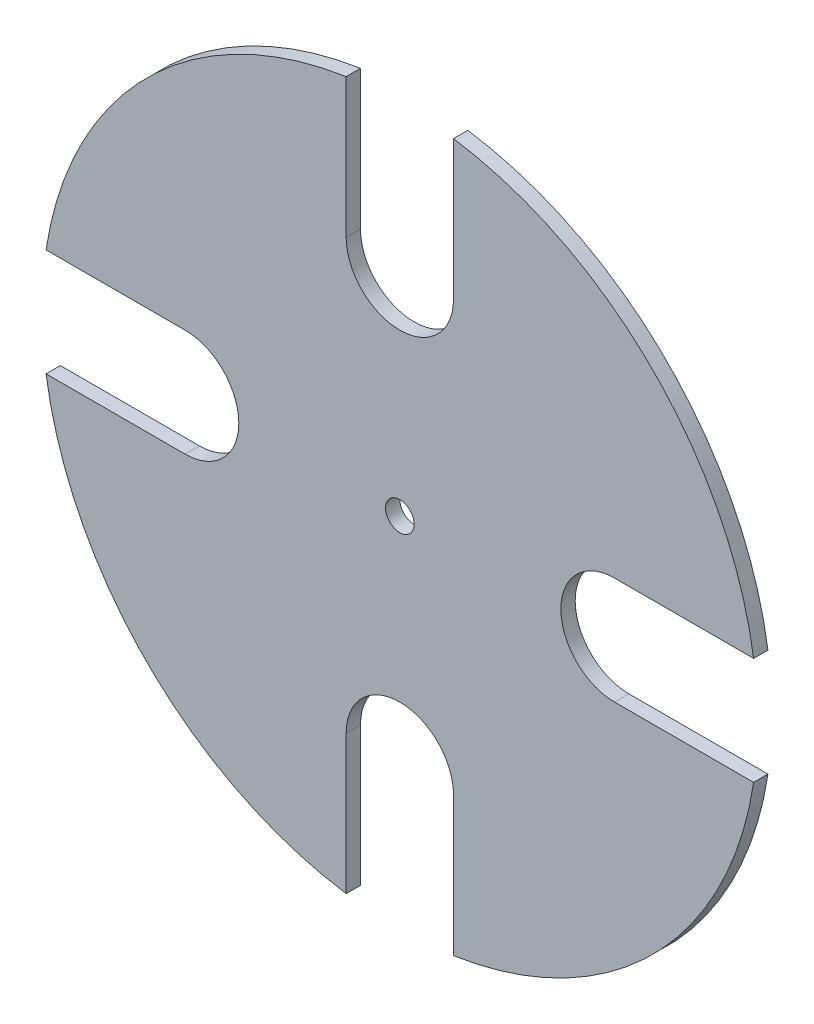
ISO-10303-21;
HEADER;
FILE_DESCRIPTION(('STEP AP214'),'2;1');
FILE_NAME('part.step','',(''),(''),'','','');
FILE_SCHEMA(('AUTOMOTIVE_DESIGN { 1 0 10303 214 1 1 1 1 }'));
ENDSEC;
DATA;
#1=APPLICATION_CONTEXT('core data for automotive mechanical design processes');
#2=APPLICATION_PROTOCOL_DEFINITION('international standard','automotive_design',2000,#1);
#3=PRODUCT_CONTEXT('',#1,'mechanical');
#4=PRODUCT('Part','Part','',(#3));
#5=PRODUCT_RELATED_PRODUCT_CATEGORY('part','',(#4));
#6=PRODUCT_DEFINITION_FORMATION('','',#4);
#7=PRODUCT_DEFINITION_CONTEXT('part definition',#1,'design');
#8=PRODUCT_DEFINITION('design','',#6,#7);
#9=PRODUCT_DEFINITION_SHAPE('','',#8);
#10=(LENGTH_UNIT() NAMED_UNIT(*) SI_UNIT(.MILLI.,.METRE.));
#11=(NAMED_UNIT(*) PLANE_ANGLE_UNIT() SI_UNIT($,.RADIAN.));
#12=(NAMED_UNIT(*) SI_UNIT($,.STERADIAN.) SOLID_ANGLE_UNIT());
#13=UNCERTAINTY_MEASURE_WITH_UNIT(LENGTH_MEASURE(1.E-05),#10,'distance_accuracy_value','');
#14=(GEOMETRIC_REPRESENTATION_CONTEXT(3) GLOBAL_UNCERTAINTY_ASSIGNED_CONTEXT((#13)) GLOBAL_UNIT_ASSIGNED_CONTEXT((#10,
#11,#12)) REPRESENTATION_CONTEXT('',''));
#15=CARTESIAN_POINT('',(0.,0.,0.));
#16=DIRECTION('',(0.,0.,1.));
#17=DIRECTION('',(1.,0.,0.));
#18=AXIS2_PLACEMENT_3D('',#15,#16,#17);
#19=CARTESIAN_POINT('',(0.,0.,4.));
#20=DIRECTION('',(0.,0.,-1.));
#21=DIRECTION('',(-1.,0.,0.));
#22=AXIS2_PLACEMENT_3D('',#19,#20,#21);
#23=CYLINDRICAL_SURFACE('',#22,100.);
#24=CARTESIAN_POINT('',(0.,0.,4.));
#25=DIRECTION('',(0.,0.,1.));
#26=DIRECTION('',(1.,0.,0.));
#27=AXIS2_PLACEMENT_3D('',#24,#25,#26);
#28=CIRCLE('',#27,100.);
#29=CARTESIAN_POINT('',(98.8685996664258,15.000000000001,4.));
#30=VERTEX_POINT('',#29);
#31=CARTESIAN_POINT('',(15.,98.868599666426,4.));
#32=VERTEX_POINT('',#31);
#33=EDGE_CURVE('E195',#30,#32,#28,.T.);
#34=ORIENTED_EDGE('',*,*,#33,.F.);
#35=DIRECTION('',(0.,0.,-1.));
#36=VECTOR('',#35,1.);
#37=CARTESIAN_POINT('',(98.8685996664258,15.000000000001,4.));
#38=LINE('',#37,#36);
#39=CARTESIAN_POINT('',(98.8685996664258,15.000000000001,0.));
#40=VERTEX_POINT('',#39);
#41=EDGE_CURVE('E260',#30,#40,#38,.T.);
#42=ORIENTED_EDGE('',*,*,#41,.T.);
#43=CARTESIAN_POINT('',(0.,0.,0.));
#44=DIRECTION('',(0.,0.,1.));
#45=DIRECTION('',(1.,0.,0.));
#46=AXIS2_PLACEMENT_3D('',#43,#44,#45);
#47=CIRCLE('',#46,100.);
#48=CARTESIAN_POINT('',(15.,98.868599666426,0.));
#49=VERTEX_POINT('',#48);
#50=EDGE_CURVE('E198',#40,#49,#47,.T.);
#51=ORIENTED_EDGE('',*,*,#50,.T.);
#52=DIRECTION('',(0.,0.,-1.));
#53=VECTOR('',#52,1.);
#54=CARTESIAN_POINT('',(15.,98.868599666426,4.));
#55=LINE('',#54,#53);
#56=EDGE_CURVE('E160',#49,#32,#55,.F.);
#57=ORIENTED_EDGE('',*,*,#56,.T.);
#58=EDGE_LOOP('',(#34,#42,#51,#57));
#59=FACE_BOUND('',#58,.T.);
#60=ADVANCED_FACE('F38',(#59),#23,.T.);
#61=CARTESIAN_POINT('',(60.,6.28466640991764E-13,357.588744164743));
#62=DIRECTION('',(0.,0.,-1.));
#63=DIRECTION('',(0.,1.,0.));
#64=AXIS2_PLACEMENT_3D('',#61,#62,#63);
#65=CYLINDRICAL_SURFACE('',#64,15.);
#66=DIRECTION('',(0.,0.,-1.));
#67=VECTOR('',#66,1.);
#68=CARTESIAN_POINT('',(60.0000000000002,-14.9999999999994,357.588744164743));
#69=LINE('',#68,#67);
#70=CARTESIAN_POINT('',(60.0000000000002,-14.9999999999994,4.));
#71=VERTEX_POINT('',#70);
#72=CARTESIAN_POINT('',(60.0000000000002,-14.9999999999994,0.));
#73=VERTEX_POINT('',#72);
#74=EDGE_CURVE('E61',#71,#73,#69,.T.);
#75=ORIENTED_EDGE('',*,*,#74,.T.);
#76=CARTESIAN_POINT('',(60.,6.28466640991764E-13,0.));
#77=DIRECTION('',(0.,0.,1.));
#78=DIRECTION('',(0.,-1.,0.));
#79=AXIS2_PLACEMENT_3D('',#76,#77,#78);
#80=CIRCLE('',#79,15.);
#81=CARTESIAN_POINT('',(59.9999999999999,15.0000000000006,0.));
#82=VERTEX_POINT('',#81);
#83=EDGE_CURVE('E46',#73,#82,#80,.F.);
#84=ORIENTED_EDGE('',*,*,#83,.T.);
#85=DIRECTION('',(0.,0.,-1.));
#86=VECTOR('',#85,1.);
#87=CARTESIAN_POINT('',(59.9999999999999,15.0000000000006,357.588744164743));
#88=LINE('',#87,#86);
#89=CARTESIAN_POINT('',(59.9999999999999,15.0000000000006,4.));
#90=VERTEX_POINT('',#89);
#91=EDGE_CURVE('E266',#90,#82,#88,.T.);
#92=ORIENTED_EDGE('',*,*,#91,.F.);
#93=CARTESIAN_POINT('',(60.,6.28466640991764E-13,4.));
#94=DIRECTION('',(0.,0.,1.));
#95=DIRECTION('',(0.,-1.,0.));
#96=AXIS2_PLACEMENT_3D('',#93,#94,#95);
#97=CIRCLE('',#96,15.);
#98=EDGE_CURVE('E11',#71,#90,#97,.F.);
#99=ORIENTED_EDGE('',*,*,#98,.F.);
#100=EDGE_LOOP('',(#75,#84,#92,#99));
#101=FACE_BOUND('',#100,.T.);
#102=ADVANCED_FACE('F40',(#101),#65,.F.);
#103=CARTESIAN_POINT('',(60.0000000000002,-14.9999999999994,357.588744164743));
#104=DIRECTION('',(0.,-1.,0.));
#105=DIRECTION('',(0.,0.,-1.));
#106=AXIS2_PLACEMENT_3D('',#103,#104,#105);
#107=PLANE('',#106);
#108=DIRECTION('',(0.,0.,-1.));
#109=VECTOR('',#108,1.);
#110=CARTESIAN_POINT('',(98.8685996664261,-14.999999999999,4.));
#111=LINE('',#110,#109);
#112=CARTESIAN_POINT('',(98.8685996664261,-14.999999999999,0.));
#113=VERTEX_POINT('',#112);
#114=CARTESIAN_POINT('',(98.8685996664261,-14.999999999999,4.));
#115=VERTEX_POINT('',#114);
#116=EDGE_CURVE('E271',#113,#115,#111,.F.);
#117=ORIENTED_EDGE('',*,*,#116,.F.);
#118=DIRECTION('',(-1.,0.,0.));
#119=VECTOR('',#118,1.);
#120=CARTESIAN_POINT('',(60.0000000000002,-14.9999999999994,0.));
#121=LINE('',#120,#119);
#122=EDGE_CURVE('E273',#113,#73,#121,.T.);
#123=ORIENTED_EDGE('',*,*,#122,.T.);
#124=ORIENTED_EDGE('',*,*,#74,.F.);
#125=DIRECTION('',(-1.,0.,0.));
#126=VECTOR('',#125,1.);
#127=CARTESIAN_POINT('',(60.0000000000002,-14.9999999999994,4.));
#128=LINE('',#127,#126);
#129=EDGE_CURVE('E276',#115,#71,#128,.T.);
#130=ORIENTED_EDGE('',*,*,#129,.F.);
#131=EDGE_LOOP('',(#117,#123,#124,#130));
#132=FACE_BOUND('',#131,.T.);
#133=ADVANCED_FACE('F289',(#132),#107,.F.);
#134=CARTESIAN_POINT('',(59.9999999999999,15.0000000000006,357.588744164743));
#135=DIRECTION('',(0.,1.,0.));
#136=DIRECTION('',(0.,0.,1.));
#137=AXIS2_PLACEMENT_3D('',#134,#135,#136);
#138=PLANE('',#137);
#139=ORIENTED_EDGE('',*,*,#41,.F.);
#140=DIRECTION('',(1.,0.,0.));
#141=VECTOR('',#140,1.);
#142=CARTESIAN_POINT('',(59.9999999999999,15.0000000000006,4.));
#143=LINE('',#142,#141);
#144=EDGE_CURVE('E263',#90,#30,#143,.T.);
#145=ORIENTED_EDGE('',*,*,#144,.F.);
#146=ORIENTED_EDGE('',*,*,#91,.T.);
#147=DIRECTION('',(1.,0.,0.));
#148=VECTOR('',#147,1.);
#149=CARTESIAN_POINT('',(59.9999999999999,15.0000000000006,0.));
#150=LINE('',#149,#148);
#151=EDGE_CURVE('E268',#82,#40,#150,.T.);
#152=ORIENTED_EDGE('',*,*,#151,.T.);
#153=EDGE_LOOP('',(#139,#145,#146,#152));
#154=FACE_BOUND('',#153,.T.);
#155=ADVANCED_FACE('F286',(#154),#138,.F.);
#156=CARTESIAN_POINT('',(15.,-98.868599666426,4.));
#157=VERTEX_POINT('',#156);
#158=EDGE_CURVE('E53',#157,#115,#28,.T.);
#159=ORIENTED_EDGE('',*,*,#158,.F.);
#160=DIRECTION('',(0.,0.,-1.));
#161=VECTOR('',#160,1.);
#162=CARTESIAN_POINT('',(15.,-98.868599666426,4.));
#163=LINE('',#162,#161);
#164=CARTESIAN_POINT('',(15.,-98.868599666426,0.));
#165=VERTEX_POINT('',#164);
#166=EDGE_CURVE('E232',#157,#165,#163,.T.);
#167=ORIENTED_EDGE('',*,*,#166,.T.);
#168=EDGE_CURVE('E236',#165,#113,#47,.T.);
#169=ORIENTED_EDGE('',*,*,#168,.T.);
#170=ORIENTED_EDGE('',*,*,#116,.T.);
#171=EDGE_LOOP('',(#159,#167,#169,#170));
#172=FACE_BOUND('',#171,.T.);
#173=ADVANCED_FACE('F291',(#172),#23,.T.);
#174=CARTESIAN_POINT('',(0.,-60.,357.588744164743));
#175=DIRECTION('',(0.,0.,-1.));
#176=DIRECTION('',(1.,0.,0.));
#177=AXIS2_PLACEMENT_3D('',#174,#175,#176);
#178=CYLINDRICAL_SURFACE('',#177,15.);
#179=DIRECTION('',(0.,0.,-1.));
#180=VECTOR('',#179,1.);
#181=CARTESIAN_POINT('',(-15.,-60.,357.588744164743));
#182=LINE('',#181,#180);
#183=CARTESIAN_POINT('',(-15.,-60.,4.));
#184=VERTEX_POINT('',#183);
#185=CARTESIAN_POINT('',(-15.,-60.,0.));
#186=VERTEX_POINT('',#185);
#187=EDGE_CURVE('E248',#184,#186,#182,.T.);
#188=ORIENTED_EDGE('',*,*,#187,.T.);
#189=CARTESIAN_POINT('',(0.,-60.,0.));
#190=DIRECTION('',(0.,0.,1.));
#191=DIRECTION('',(-1.,0.,0.));
#192=AXIS2_PLACEMENT_3D('',#189,#190,#191);
#193=CIRCLE('',#192,15.);
#194=CARTESIAN_POINT('',(15.,-60.,0.));
#195=VERTEX_POINT('',#194);
#196=EDGE_CURVE('E254',#186,#195,#193,.F.);
#197=ORIENTED_EDGE('',*,*,#196,.T.);
#198=DIRECTION('',(0.,0.,-1.));
#199=VECTOR('',#198,1.);
#200=CARTESIAN_POINT('',(15.,-60.,357.588744164743));
#201=LINE('',#200,#199);
#202=CARTESIAN_POINT('',(15.,-60.,4.));
#203=VERTEX_POINT('',#202);
#204=EDGE_CURVE('E238',#203,#195,#201,.T.);
#205=ORIENTED_EDGE('',*,*,#204,.F.);
#206=CARTESIAN_POINT('',(0.,-60.,4.));
#207=DIRECTION('',(0.,0.,1.));
#208=DIRECTION('',(-1.,0.,0.));
#209=AXIS2_PLACEMENT_3D('',#206,#207,#208);
#210=CIRCLE('',#209,15.);
#211=EDGE_CURVE('E257',#184,#203,#210,.F.);
#212=ORIENTED_EDGE('',*,*,#211,.F.);
#213=EDGE_LOOP('',(#188,#197,#205,#212));
#214=FACE_BOUND('',#213,.T.);
#215=ADVANCED_FACE('F304',(#214),#178,.F.);
#216=CARTESIAN_POINT('',(-15.,-60.,357.588744164743));
#217=DIRECTION('',(-1.,0.,0.));
#218=DIRECTION('',(0.,0.,-1.));
#219=AXIS2_PLACEMENT_3D('',#216,#217,#218);
#220=PLANE('',#219);
#221=DIRECTION('',(0.,0.,-1.));
#222=VECTOR('',#221,1.);
#223=CARTESIAN_POINT('',(-15.,-98.868599666426,4.));
#224=LINE('',#223,#222);
#225=CARTESIAN_POINT('',(-15.,-98.868599666426,0.));
#226=VERTEX_POINT('',#225);
#227=CARTESIAN_POINT('',(-15.,-98.868599666426,4.));
#228=VERTEX_POINT('',#227);
#229=EDGE_CURVE('E243',#226,#228,#224,.F.);
#230=ORIENTED_EDGE('',*,*,#229,.F.);
#231=DIRECTION('',(0.,1.,0.));
#232=VECTOR('',#231,1.);
#233=CARTESIAN_POINT('',(-15.,-60.,0.));
#234=LINE('',#233,#232);
#235=EDGE_CURVE('E246',#226,#186,#234,.T.);
#236=ORIENTED_EDGE('',*,*,#235,.T.);
#237=ORIENTED_EDGE('',*,*,#187,.F.);
#238=DIRECTION('',(0.,1.,0.));
#239=VECTOR('',#238,1.);
#240=CARTESIAN_POINT('',(-15.,-60.,4.));
#241=LINE('',#240,#239);
#242=EDGE_CURVE('E251',#228,#184,#241,.T.);
#243=ORIENTED_EDGE('',*,*,#242,.F.);
#244=EDGE_LOOP('',(#230,#236,#237,#243));
#245=FACE_BOUND('',#244,.T.);
#246=ADVANCED_FACE('F329',(#245),#220,.F.);
#247=CARTESIAN_POINT('',(15.,-60.,357.588744164743));
#248=DIRECTION('',(1.,0.,0.));
#249=DIRECTION('',(0.,0.,1.));
#250=AXIS2_PLACEMENT_3D('',#247,#248,#249);
#251=PLANE('',#250);
#252=ORIENTED_EDGE('',*,*,#166,.F.);
#253=DIRECTION('',(0.,-1.,0.));
#254=VECTOR('',#253,1.);
#255=CARTESIAN_POINT('',(15.,-60.,4.));
#256=LINE('',#255,#254);
#257=EDGE_CURVE('E235',#203,#157,#256,.T.);
#258=ORIENTED_EDGE('',*,*,#257,.F.);
#259=ORIENTED_EDGE('',*,*,#204,.T.);
#260=DIRECTION('',(0.,-1.,0.));
#261=VECTOR('',#260,1.);
#262=CARTESIAN_POINT('',(15.,-60.,0.));
#263=LINE('',#262,#261);
#264=EDGE_CURVE('E240',#195,#165,#263,.T.);
#265=ORIENTED_EDGE('',*,*,#264,.T.);
#266=EDGE_LOOP('',(#252,#258,#259,#265));
#267=FACE_BOUND('',#266,.T.);
#268=ADVANCED_FACE('F320',(#267),#251,.F.);
#269=CARTESIAN_POINT('',(-98.8685996664259,-15.0000000000003,4.));
#270=VERTEX_POINT('',#269);
#271=EDGE_CURVE('E196',#270,#228,#28,.T.);
#272=ORIENTED_EDGE('',*,*,#271,.F.);
#273=DIRECTION('',(0.,0.,-1.));
#274=VECTOR('',#273,1.);
#275=CARTESIAN_POINT('',(-98.8685996664259,-15.0000000000003,4.));
#276=LINE('',#275,#274);
#277=CARTESIAN_POINT('',(-98.8685996664259,-15.0000000000003,0.));
#278=VERTEX_POINT('',#277);
#279=EDGE_CURVE('E204',#270,#278,#276,.T.);
#280=ORIENTED_EDGE('',*,*,#279,.T.);
#281=EDGE_CURVE('E199',#278,#226,#47,.T.);
#282=ORIENTED_EDGE('',*,*,#281,.T.);
#283=ORIENTED_EDGE('',*,*,#229,.T.);
#284=EDGE_LOOP('',(#272,#280,#282,#283));
#285=FACE_BOUND('',#284,.T.);
#286=ADVANCED_FACE('F305',(#285),#23,.T.);
#287=CARTESIAN_POINT('',(-60.,-2.09488880330588E-13,357.588744164743));
#288=DIRECTION('',(0.,0.,-1.));
#289=DIRECTION('',(0.,-1.,0.));
#290=AXIS2_PLACEMENT_3D('',#287,#288,#289);
#291=CYLINDRICAL_SURFACE('',#290,15.);
#292=DIRECTION('',(0.,0.,-1.));
#293=VECTOR('',#292,1.);
#294=CARTESIAN_POINT('',(-60.0000000000001,14.9999999999998,357.588744164743));
#295=LINE('',#294,#293);
#296=CARTESIAN_POINT('',(-60.0000000000001,14.9999999999998,4.));
#297=VERTEX_POINT('',#296);
#298=CARTESIAN_POINT('',(-60.0000000000001,14.9999999999998,0.));
#299=VERTEX_POINT('',#298);
#300=EDGE_CURVE('E220',#297,#299,#295,.T.);
#301=ORIENTED_EDGE('',*,*,#300,.T.);
#302=CARTESIAN_POINT('',(-60.,-2.09488880330588E-13,0.));
#303=DIRECTION('',(0.,0.,1.));
#304=DIRECTION('',(0.,1.,0.));
#305=AXIS2_PLACEMENT_3D('',#302,#303,#304);
#306=CIRCLE('',#305,15.);
#307=CARTESIAN_POINT('',(-60.,-15.0000000000002,0.));
#308=VERTEX_POINT('',#307);
#309=EDGE_CURVE('E226',#299,#308,#306,.F.);
#310=ORIENTED_EDGE('',*,*,#309,.T.);
#311=DIRECTION('',(0.,0.,-1.));
#312=VECTOR('',#311,1.);
#313=CARTESIAN_POINT('',(-60.,-15.0000000000002,357.588744164743));
#314=LINE('',#313,#312);
#315=CARTESIAN_POINT('',(-60.,-15.0000000000002,4.));
#316=VERTEX_POINT('',#315);
#317=EDGE_CURVE('E210',#316,#308,#314,.T.);
#318=ORIENTED_EDGE('',*,*,#317,.F.);
#319=CARTESIAN_POINT('',(-60.,-2.09488880330588E-13,4.));
#320=DIRECTION('',(0.,0.,1.));
#321=DIRECTION('',(0.,1.,0.));
#322=AXIS2_PLACEMENT_3D('',#319,#320,#321);
#323=CIRCLE('',#322,15.);
#324=EDGE_CURVE('E229',#297,#316,#323,.F.);
#325=ORIENTED_EDGE('',*,*,#324,.F.);
#326=EDGE_LOOP('',(#301,#310,#318,#325));
#327=FACE_BOUND('',#326,.T.);
#328=ADVANCED_FACE('F319',(#327),#291,.F.);
#329=CARTESIAN_POINT('',(-60.0000000000001,14.9999999999998,357.588744164743));
#330=DIRECTION('',(0.,1.,0.));
#331=DIRECTION('',(0.,0.,-1.));
#332=AXIS2_PLACEMENT_3D('',#329,#330,#331);
#333=PLANE('',#332);
#334=DIRECTION('',(0.,0.,-1.));
#335=VECTOR('',#334,1.);
#336=CARTESIAN_POINT('',(-98.868599666426,14.9999999999997,4.));
#337=LINE('',#336,#335);
#338=CARTESIAN_POINT('',(-98.868599666426,14.9999999999997,0.));
#339=VERTEX_POINT('',#338);
#340=CARTESIAN_POINT('',(-98.868599666426,14.9999999999997,4.));
#341=VERTEX_POINT('',#340);
#342=EDGE_CURVE('E215',#339,#341,#337,.F.);
#343=ORIENTED_EDGE('',*,*,#342,.F.);
#344=DIRECTION('',(1.,0.,0.));
#345=VECTOR('',#344,1.);
#346=CARTESIAN_POINT('',(-60.0000000000001,14.9999999999998,0.));
#347=LINE('',#346,#345);
#348=EDGE_CURVE('E218',#339,#299,#347,.T.);
#349=ORIENTED_EDGE('',*,*,#348,.T.);
#350=ORIENTED_EDGE('',*,*,#300,.F.);
#351=DIRECTION('',(1.,0.,0.));
#352=VECTOR('',#351,1.);
#353=CARTESIAN_POINT('',(-60.0000000000001,14.9999999999998,4.));
#354=LINE('',#353,#352);
#355=EDGE_CURVE('E223',#341,#297,#354,.T.);
#356=ORIENTED_EDGE('',*,*,#355,.F.);
#357=EDGE_LOOP('',(#343,#349,#350,#356));
#358=FACE_BOUND('',#357,.T.);
#359=ADVANCED_FACE('F326',(#358),#333,.F.);
#360=CARTESIAN_POINT('',(-60.,-15.0000000000002,357.588744164743));
#361=DIRECTION('',(0.,-1.,0.));
#362=DIRECTION('',(0.,0.,1.));
#363=AXIS2_PLACEMENT_3D('',#360,#361,#362);
#364=PLANE('',#363);
#365=ORIENTED_EDGE('',*,*,#279,.F.);
#366=DIRECTION('',(-1.,0.,0.));
#367=VECTOR('',#366,1.);
#368=CARTESIAN_POINT('',(-60.,-15.0000000000002,4.));
#369=LINE('',#368,#367);
#370=EDGE_CURVE('E207',#316,#270,#369,.T.);
#371=ORIENTED_EDGE('',*,*,#370,.F.);
#372=ORIENTED_EDGE('',*,*,#317,.T.);
#373=DIRECTION('',(-1.,0.,0.));
#374=VECTOR('',#373,1.);
#375=CARTESIAN_POINT('',(-60.,-15.0000000000002,0.));
#376=LINE('',#375,#374);
#377=EDGE_CURVE('E212',#308,#278,#376,.T.);
#378=ORIENTED_EDGE('',*,*,#377,.T.);
#379=EDGE_LOOP('',(#365,#371,#372,#378));
#380=FACE_BOUND('',#379,.T.);
#381=ADVANCED_FACE('F336',(#380),#364,.F.);
#382=CARTESIAN_POINT('',(0.,0.,4.));
#383=DIRECTION('',(0.,0.,1.));
#384=DIRECTION('',(1.,0.,0.));
#385=AXIS2_PLACEMENT_3D('',#382,#383,#384);
#386=PLANE('',#385);
#387=CARTESIAN_POINT('',(0.,0.,4.));
#388=DIRECTION('',(0.,0.,1.));
#389=DIRECTION('',(1.,0.,0.));
#390=AXIS2_PLACEMENT_3D('',#387,#388,#389);
#391=CIRCLE('',#390,4.);
#392=CARTESIAN_POINT('',(4.,0.,4.));
#393=VERTEX_POINT('',#392);
#394=EDGE_CURVE('E185',#393,#393,#391,.T.);
#395=ORIENTED_EDGE('',*,*,#394,.F.);
#396=EDGE_LOOP('',(#395));
#397=FACE_BOUND('',#396,.T.);
#398=ORIENTED_EDGE('',*,*,#158,.T.);
#399=ORIENTED_EDGE('',*,*,#129,.T.);
#400=ORIENTED_EDGE('',*,*,#98,.T.);
#401=ORIENTED_EDGE('',*,*,#144,.T.);
#402=ORIENTED_EDGE('',*,*,#33,.T.);
#403=DIRECTION('',(0.,-1.,0.));
#404=VECTOR('',#403,1.);
#405=CARTESIAN_POINT('',(15.,60.,4.));
#406=LINE('',#405,#404);
#407=CARTESIAN_POINT('',(15.,60.,4.));
#408=VERTEX_POINT('',#407);
#409=EDGE_CURVE('E192',#32,#408,#406,.T.);
#410=ORIENTED_EDGE('',*,*,#409,.T.);
#411=CARTESIAN_POINT('',(0.,60.,4.));
#412=DIRECTION('',(0.,0.,1.));
#413=DIRECTION('',(1.,0.,0.));
#414=AXIS2_PLACEMENT_3D('',#411,#412,#413);
#415=CIRCLE('',#414,15.);
#416=CARTESIAN_POINT('',(-15.,60.,4.));
#417=VERTEX_POINT('',#416);
#418=EDGE_CURVE('E170',#408,#417,#415,.F.);
#419=ORIENTED_EDGE('',*,*,#418,.T.);
#420=DIRECTION('',(0.,1.,0.));
#421=VECTOR('',#420,1.);
#422=CARTESIAN_POINT('',(-15.,60.,4.));
#423=LINE('',#422,#421);
#424=CARTESIAN_POINT('',(-15.,98.868599666426,4.));
#425=VERTEX_POINT('',#424);
#426=EDGE_CURVE('E182',#417,#425,#423,.T.);
#427=ORIENTED_EDGE('',*,*,#426,.T.);
#428=EDGE_CURVE('E193',#425,#341,#28,.T.);
#429=ORIENTED_EDGE('',*,*,#428,.T.);
#430=ORIENTED_EDGE('',*,*,#355,.T.);
#431=ORIENTED_EDGE('',*,*,#324,.T.);
#432=ORIENTED_EDGE('',*,*,#370,.T.);
#433=ORIENTED_EDGE('',*,*,#271,.T.);
#434=ORIENTED_EDGE('',*,*,#242,.T.);
#435=ORIENTED_EDGE('',*,*,#211,.T.);
#436=ORIENTED_EDGE('',*,*,#257,.T.);
#437=EDGE_LOOP('',(#398,#399,#400,#401,#402,#410,#419,#427,#429,#430,#431,#432,#433,#434,#435,#436));
#438=FACE_BOUND('',#437,.T.);
#439=ADVANCED_FACE('F287',(#397,#438),#386,.T.);
#440=CARTESIAN_POINT('',(0.,0.,0.));
#441=DIRECTION('',(0.,0.,1.));
#442=DIRECTION('',(1.,0.,0.));
#443=AXIS2_PLACEMENT_3D('',#440,#441,#442);
#444=PLANE('',#443);
#445=CARTESIAN_POINT('',(0.,0.,0.));
#446=DIRECTION('',(0.,0.,1.));
#447=DIRECTION('',(1.,0.,0.));
#448=AXIS2_PLACEMENT_3D('',#445,#446,#447);
#449=CIRCLE('',#448,4.);
#450=CARTESIAN_POINT('',(4.,0.,0.));
#451=VERTEX_POINT('',#450);
#452=EDGE_CURVE('E189',#451,#451,#449,.T.);
#453=ORIENTED_EDGE('',*,*,#452,.T.);
#454=EDGE_LOOP('',(#453));
#455=FACE_BOUND('',#454,.T.);
#456=ORIENTED_EDGE('',*,*,#168,.F.);
#457=ORIENTED_EDGE('',*,*,#264,.F.);
#458=ORIENTED_EDGE('',*,*,#196,.F.);
#459=ORIENTED_EDGE('',*,*,#235,.F.);
#460=ORIENTED_EDGE('',*,*,#281,.F.);
#461=ORIENTED_EDGE('',*,*,#377,.F.);
#462=ORIENTED_EDGE('',*,*,#309,.F.);
#463=ORIENTED_EDGE('',*,*,#348,.F.);
#464=CARTESIAN_POINT('',(-15.,98.868599666426,0.));
#465=VERTEX_POINT('',#464);
#466=EDGE_CURVE('E188',#465,#339,#47,.T.);
#467=ORIENTED_EDGE('',*,*,#466,.F.);
#468=DIRECTION('',(0.,1.,0.));
#469=VECTOR('',#468,1.);
#470=CARTESIAN_POINT('',(-15.,60.,0.));
#471=LINE('',#470,#469);
#472=CARTESIAN_POINT('',(-15.,60.,0.));
#473=VERTEX_POINT('',#472);
#474=EDGE_CURVE('E172',#473,#465,#471,.T.);
#475=ORIENTED_EDGE('',*,*,#474,.F.);
#476=CARTESIAN_POINT('',(0.,60.,0.));
#477=DIRECTION('',(0.,0.,1.));
#478=DIRECTION('',(1.,0.,0.));
#479=AXIS2_PLACEMENT_3D('',#476,#477,#478);
#480=CIRCLE('',#479,15.);
#481=CARTESIAN_POINT('',(15.,60.,0.));
#482=VERTEX_POINT('',#481);
#483=EDGE_CURVE('E163',#482,#473,#480,.F.);
#484=ORIENTED_EDGE('',*,*,#483,.F.);
#485=DIRECTION('',(0.,-1.,0.));
#486=VECTOR('',#485,1.);
#487=CARTESIAN_POINT('',(15.,60.,0.));
#488=LINE('',#487,#486);
#489=EDGE_CURVE('E153',#49,#482,#488,.T.);
#490=ORIENTED_EDGE('',*,*,#489,.F.);
#491=ORIENTED_EDGE('',*,*,#50,.F.);
#492=ORIENTED_EDGE('',*,*,#151,.F.);
#493=ORIENTED_EDGE('',*,*,#83,.F.);
#494=ORIENTED_EDGE('',*,*,#122,.F.);
#495=EDGE_LOOP('',(#456,#457,#458,#459,#460,#461,#462,#463,#467,#475,#484,#490,#491,#492,#493,#494));
#496=FACE_BOUND('',#495,.T.);
#497=ADVANCED_FACE('F175',(#455,#496),#444,.F.);
#498=ORIENTED_EDGE('',*,*,#428,.F.);
#499=DIRECTION('',(0.,0.,-1.));
#500=VECTOR('',#499,1.);
#501=CARTESIAN_POINT('',(-15.,98.868599666426,4.));
#502=LINE('',#501,#500);
#503=EDGE_CURVE('E201',#425,#465,#502,.T.);
#504=ORIENTED_EDGE('',*,*,#503,.T.);
#505=ORIENTED_EDGE('',*,*,#466,.T.);
#506=ORIENTED_EDGE('',*,*,#342,.T.);
#507=EDGE_LOOP('',(#498,#504,#505,#506));
#508=FACE_BOUND('',#507,.T.);
#509=ADVANCED_FACE('F297',(#508),#23,.T.);
#510=CARTESIAN_POINT('',(0.,0.,4.));
#511=DIRECTION('',(0.,0.,-1.));
#512=DIRECTION('',(-1.,0.,0.));
#513=AXIS2_PLACEMENT_3D('',#510,#511,#512);
#514=CYLINDRICAL_SURFACE('',#513,4.);
#515=ORIENTED_EDGE('',*,*,#394,.T.);
#516=EDGE_LOOP('',(#515));
#517=FACE_BOUND('',#516,.T.);
#518=ORIENTED_EDGE('',*,*,#452,.F.);
#519=EDGE_LOOP('',(#518));
#520=FACE_BOUND('',#519,.T.);
#521=ADVANCED_FACE('F307',(#517,#520),#514,.F.);
#522=CARTESIAN_POINT('',(-15.,60.,357.588744164743));
#523=DIRECTION('',(-1.,0.,0.));
#524=DIRECTION('',(0.,0.,1.));
#525=AXIS2_PLACEMENT_3D('',#522,#523,#524);
#526=PLANE('',#525);
#527=ORIENTED_EDGE('',*,*,#503,.F.);
#528=ORIENTED_EDGE('',*,*,#426,.F.);
#529=DIRECTION('',(0.,0.,-1.));
#530=VECTOR('',#529,1.);
#531=CARTESIAN_POINT('',(-15.,60.,357.588744164743));
#532=LINE('',#531,#530);
#533=EDGE_CURVE('E171',#417,#473,#532,.T.);
#534=ORIENTED_EDGE('',*,*,#533,.T.);
#535=ORIENTED_EDGE('',*,*,#474,.T.);
#536=EDGE_LOOP('',(#527,#528,#534,#535));
#537=FACE_BOUND('',#536,.T.);
#538=ADVANCED_FACE('F313',(#537),#526,.F.);
#539=CARTESIAN_POINT('',(15.,60.,357.588744164743));
#540=DIRECTION('',(1.,0.,0.));
#541=DIRECTION('',(0.,0.,-1.));
#542=AXIS2_PLACEMENT_3D('',#539,#540,#541);
#543=PLANE('',#542);
#544=ORIENTED_EDGE('',*,*,#56,.F.);
#545=ORIENTED_EDGE('',*,*,#489,.T.);
#546=DIRECTION('',(0.,0.,-1.));
#547=VECTOR('',#546,1.);
#548=CARTESIAN_POINT('',(15.,60.,357.588744164743));
#549=LINE('',#548,#547);
#550=EDGE_CURVE('E157',#408,#482,#549,.T.);
#551=ORIENTED_EDGE('',*,*,#550,.F.);
#552=ORIENTED_EDGE('',*,*,#409,.F.);
#553=EDGE_LOOP('',(#544,#545,#551,#552));
#554=FACE_BOUND('',#553,.T.);
#555=ADVANCED_FACE('F155',(#554),#543,.F.);
#556=CARTESIAN_POINT('',(0.,60.,357.588744164743));
#557=DIRECTION('',(0.,0.,-1.));
#558=DIRECTION('',(-1.,0.,0.));
#559=AXIS2_PLACEMENT_3D('',#556,#557,#558);
#560=CYLINDRICAL_SURFACE('',#559,15.);
#561=ORIENTED_EDGE('',*,*,#550,.T.);
#562=ORIENTED_EDGE('',*,*,#483,.T.);
#563=ORIENTED_EDGE('',*,*,#533,.F.);
#564=ORIENTED_EDGE('',*,*,#418,.F.);
#565=EDGE_LOOP('',(#561,#562,#563,#564));
#566=FACE_BOUND('',#565,.T.);
#567=ADVANCED_FACE('F166',(#566),#560,.F.);
#568=CLOSED_SHELL('',(#60,#102,#133,#155,#173,#215,#246,#268,#286,#328,#359,#381,#439,#497,#509,
#521,#538,#555,#567));
#569=MANIFOLD_SOLID_BREP('B2',#568);
#570=ADVANCED_BREP_SHAPE_REPRESENTATION('',(#18,#569),#14);
#571=SHAPE_DEFINITION_REPRESENTATION(#9,#570);
ENDSEC;
END-ISO-10303-21;
